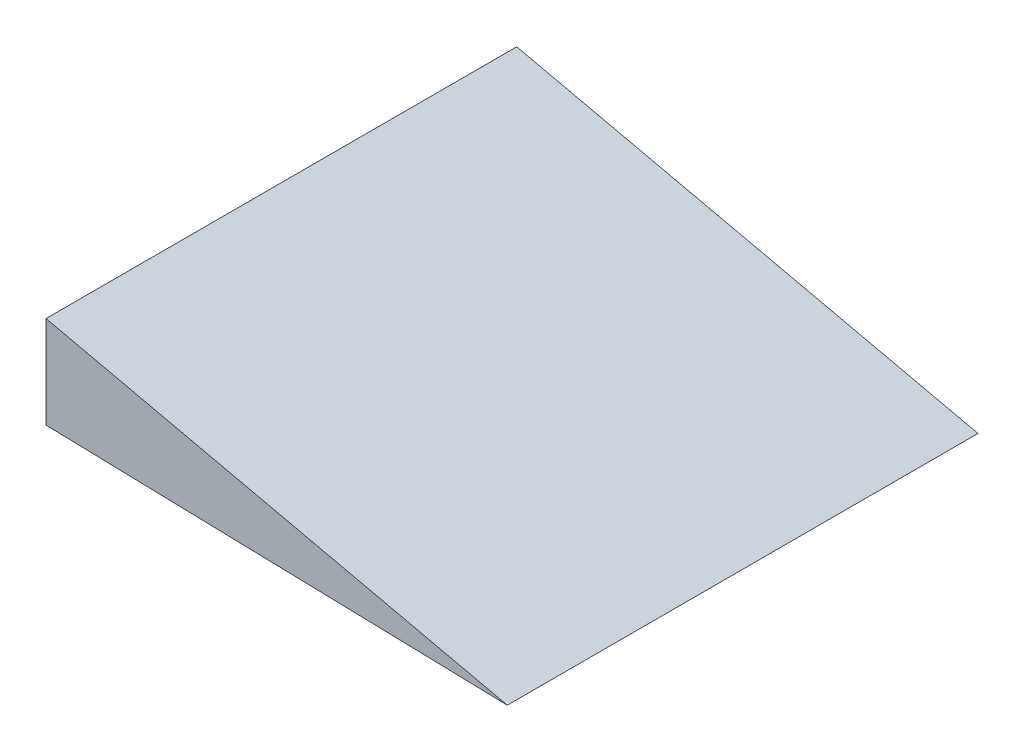
ISO-10303-21;
HEADER;
FILE_DESCRIPTION(('STEP AP214'),'2;1');
FILE_NAME('part.step','',(''),(''),'','','');
FILE_SCHEMA(('AUTOMOTIVE_DESIGN { 1 0 10303 214 1 1 1 1 }'));
ENDSEC;
DATA;
#1=APPLICATION_CONTEXT('core data for automotive mechanical design processes');
#2=APPLICATION_PROTOCOL_DEFINITION('international standard','automotive_design',2000,#1);
#3=PRODUCT_CONTEXT('',#1,'mechanical');
#4=PRODUCT('Part','Part','',(#3));
#5=PRODUCT_RELATED_PRODUCT_CATEGORY('part','',(#4));
#6=PRODUCT_DEFINITION_FORMATION('','',#4);
#7=PRODUCT_DEFINITION_CONTEXT('part definition',#1,'design');
#8=PRODUCT_DEFINITION('design','',#6,#7);
#9=PRODUCT_DEFINITION_SHAPE('','',#8);
#10=(LENGTH_UNIT() NAMED_UNIT(*) SI_UNIT(.MILLI.,.METRE.));
#11=(NAMED_UNIT(*) PLANE_ANGLE_UNIT() SI_UNIT($,.RADIAN.));
#12=(NAMED_UNIT(*) SI_UNIT($,.STERADIAN.) SOLID_ANGLE_UNIT());
#13=UNCERTAINTY_MEASURE_WITH_UNIT(LENGTH_MEASURE(1.E-05),#10,'distance_accuracy_value','');
#14=(GEOMETRIC_REPRESENTATION_CONTEXT(3) GLOBAL_UNCERTAINTY_ASSIGNED_CONTEXT((#13)) GLOBAL_UNIT_ASSIGNED_CONTEXT((#10,
#11,#12)) REPRESENTATION_CONTEXT('',''));
#15=CARTESIAN_POINT('',(0.,0.,0.));
#16=DIRECTION('',(0.,0.,1.));
#17=DIRECTION('',(1.,0.,0.));
#18=AXIS2_PLACEMENT_3D('',#15,#16,#17);
#19=CARTESIAN_POINT('',(78.8343772829701,-9.19981161972341,102.));
#20=DIRECTION('',(-0.220344878282843,-0.975422028977467,0.));
#21=DIRECTION('',(0.975422028977467,-0.220344878282843,0.));
#22=AXIS2_PLACEMENT_3D('',#19,#20,#21);
#23=PLANE('',#22);
#24=DIRECTION('',(-0.975422028977467,0.220344878282843,0.));
#25=VECTOR('',#24,1.);
#26=CARTESIAN_POINT('',(78.8343772829701,-9.19981161972341,0.));
#27=LINE('',#26,#25);
#28=CARTESIAN_POINT('',(78.8343772829701,-9.19981161972341,0.));
#29=VERTEX_POINT('',#28);
#30=CARTESIAN_POINT('',(-21.1322792890111,13.3823529411765,0.));
#31=VERTEX_POINT('',#30);
#32=EDGE_CURVE('E80',#29,#31,#27,.T.);
#33=ORIENTED_EDGE('',*,*,#32,.T.);
#34=DIRECTION('',(0.,0.,-1.));
#35=VECTOR('',#34,1.);
#36=CARTESIAN_POINT('',(-21.1322792890111,13.3823529411765,102.));
#37=LINE('',#36,#35);
#38=CARTESIAN_POINT('',(-21.1322792890111,13.3823529411765,102.));
#39=VERTEX_POINT('',#38);
#40=EDGE_CURVE('E11',#39,#31,#37,.T.);
#41=ORIENTED_EDGE('',*,*,#40,.F.);
#42=DIRECTION('',(-0.975422028977467,0.220344878282843,0.));
#43=VECTOR('',#42,1.);
#44=CARTESIAN_POINT('',(78.8343772829701,-9.19981161972341,102.));
#45=LINE('',#44,#43);
#46=CARTESIAN_POINT('',(78.8343772829701,-9.19981161972341,102.));
#47=VERTEX_POINT('',#46);
#48=EDGE_CURVE('E73',#47,#39,#45,.T.);
#49=ORIENTED_EDGE('',*,*,#48,.F.);
#50=DIRECTION('',(0.,0.,-1.));
#51=VECTOR('',#50,1.);
#52=CARTESIAN_POINT('',(78.8343772829701,-9.19981161972341,102.));
#53=LINE('',#52,#51);
#54=EDGE_CURVE('E81',#47,#29,#53,.T.);
#55=ORIENTED_EDGE('',*,*,#54,.T.);
#56=EDGE_LOOP('',(#33,#41,#49,#55));
#57=FACE_BOUND('',#56,.T.);
#58=ADVANCED_FACE('F33',(#57),#23,.F.);
#59=CARTESIAN_POINT('',(-21.1322792890111,13.3823529411765,102.));
#60=DIRECTION('',(1.,0.,0.));
#61=DIRECTION('',(0.,0.,-1.));
#62=AXIS2_PLACEMENT_3D('',#59,#60,#61);
#63=PLANE('',#62);
#64=DIRECTION('',(0.,-1.,0.));
#65=VECTOR('',#64,1.);
#66=CARTESIAN_POINT('',(-21.1322792890111,13.3823529411765,0.));
#67=LINE('',#66,#65);
#68=CARTESIAN_POINT('',(-21.1322792890111,-6.61764705882353,0.));
#69=VERTEX_POINT('',#68);
#70=EDGE_CURVE('E61',#31,#69,#67,.T.);
#71=ORIENTED_EDGE('',*,*,#70,.T.);
#72=DIRECTION('',(0.,0.,-1.));
#73=VECTOR('',#72,1.);
#74=CARTESIAN_POINT('',(-21.1322792890111,-6.61764705882353,102.));
#75=LINE('',#74,#73);
#76=CARTESIAN_POINT('',(-21.1322792890111,-6.61764705882353,102.));
#77=VERTEX_POINT('',#76);
#78=EDGE_CURVE('E41',#77,#69,#75,.T.);
#79=ORIENTED_EDGE('',*,*,#78,.F.);
#80=DIRECTION('',(0.,-1.,0.));
#81=VECTOR('',#80,1.);
#82=CARTESIAN_POINT('',(-21.1322792890111,13.3823529411765,102.));
#83=LINE('',#82,#81);
#84=EDGE_CURVE('E69',#39,#77,#83,.T.);
#85=ORIENTED_EDGE('',*,*,#84,.F.);
#86=ORIENTED_EDGE('',*,*,#40,.T.);
#87=EDGE_LOOP('',(#71,#79,#85,#86));
#88=FACE_BOUND('',#87,.T.);
#89=ADVANCED_FACE('F70',(#88),#63,.F.);
#90=CARTESIAN_POINT('',(-21.1322792890111,-6.61764705882353,102.));
#91=DIRECTION('',(0.0258216456089988,0.999666565719812,0.));
#92=DIRECTION('',(-0.999666565719812,0.0258216456089988,0.));
#93=AXIS2_PLACEMENT_3D('',#90,#91,#92);
#94=PLANE('',#93);
#95=CARTESIAN_POINT('',(3.85938485398419,-7.2631881990485,77.));
#96=DIRECTION('',(-0.0258216456089988,-0.999666565719812,0.));
#97=DIRECTION('',(0.999666565719812,-0.0258216456089988,0.));
#98=AXIS2_PLACEMENT_3D('',#95,#96,#97);
#99=CIRCLE('',#98,1.5);
#100=CARTESIAN_POINT('',(5.35888470256391,-7.301920667462,77.));
#101=VERTEX_POINT('',#100);
#102=EDGE_CURVE('E119',#101,#101,#99,.T.);
#103=ORIENTED_EDGE('',*,*,#102,.F.);
#104=EDGE_LOOP('',(#103));
#105=FACE_BOUND('',#104,.T.);
#106=CARTESIAN_POINT('',(3.85938485398419,-7.2631881990485,25.));
#107=DIRECTION('',(-0.0258216456089988,-0.999666565719812,0.));
#108=DIRECTION('',(0.999666565719812,-0.0258216456089988,0.));
#109=AXIS2_PLACEMENT_3D('',#106,#107,#108);
#110=CIRCLE('',#109,1.5);
#111=CARTESIAN_POINT('',(5.35888470256391,-7.301920667462,25.));
#112=VERTEX_POINT('',#111);
#113=EDGE_CURVE('E87',#112,#112,#110,.T.);
#114=ORIENTED_EDGE('',*,*,#113,.F.);
#115=EDGE_LOOP('',(#114));
#116=FACE_BOUND('',#115,.T.);
#117=DIRECTION('',(0.999666565719812,-0.0258216456089988,0.));
#118=VECTOR('',#117,1.);
#119=CARTESIAN_POINT('',(-21.1322792890111,-6.61764705882353,0.));
#120=LINE('',#119,#118);
#121=EDGE_CURVE('E66',#69,#29,#120,.T.);
#122=ORIENTED_EDGE('',*,*,#121,.T.);
#123=ORIENTED_EDGE('',*,*,#54,.F.);
#124=DIRECTION('',(0.999666565719812,-0.0258216456089988,0.));
#125=VECTOR('',#124,1.);
#126=CARTESIAN_POINT('',(-21.1322792890111,-6.61764705882353,102.));
#127=LINE('',#126,#125);
#128=EDGE_CURVE('E49',#77,#47,#127,.T.);
#129=ORIENTED_EDGE('',*,*,#128,.F.);
#130=ORIENTED_EDGE('',*,*,#78,.T.);
#131=EDGE_LOOP('',(#122,#123,#129,#130));
#132=FACE_BOUND('',#131,.T.);
#133=ADVANCED_FACE('F92',(#105,#116,#132),#94,.F.);
#134=CARTESIAN_POINT('',(0.,0.,102.));
#135=DIRECTION('',(0.,0.,1.));
#136=DIRECTION('',(1.,0.,0.));
#137=AXIS2_PLACEMENT_3D('',#134,#135,#136);
#138=PLANE('',#137);
#139=ORIENTED_EDGE('',*,*,#48,.T.);
#140=ORIENTED_EDGE('',*,*,#84,.T.);
#141=ORIENTED_EDGE('',*,*,#128,.T.);
#142=EDGE_LOOP('',(#139,#140,#141));
#143=FACE_BOUND('',#142,.T.);
#144=ADVANCED_FACE('F76',(#143),#138,.T.);
#145=CARTESIAN_POINT('',(0.,0.,0.));
#146=DIRECTION('',(0.,0.,1.));
#147=DIRECTION('',(1.,0.,0.));
#148=AXIS2_PLACEMENT_3D('',#145,#146,#147);
#149=PLANE('',#148);
#150=ORIENTED_EDGE('',*,*,#32,.F.);
#151=ORIENTED_EDGE('',*,*,#121,.F.);
#152=ORIENTED_EDGE('',*,*,#70,.F.);
#153=EDGE_LOOP('',(#150,#151,#152));
#154=FACE_BOUND('',#153,.T.);
#155=ADVANCED_FACE('F93',(#154),#149,.F.);
#156=CARTESIAN_POINT('',(4.11760131007418,2.73347745814962,25.));
#157=DIRECTION('',(-0.0258216456089988,-0.999666565719812,0.));
#158=DIRECTION('',(0.999666565719812,-0.0258216456089988,0.));
#159=AXIS2_PLACEMENT_3D('',#156,#157,#158);
#160=CYLINDRICAL_SURFACE('',#159,1.5);
#161=CARTESIAN_POINT('',(4.11760131007418,2.73347745814962,25.));
#162=DIRECTION('',(-0.0258216456089988,-0.999666565719812,0.));
#163=DIRECTION('',(0.999666565719812,-0.0258216456089988,0.));
#164=AXIS2_PLACEMENT_3D('',#161,#162,#163);
#165=CIRCLE('',#164,1.5);
#166=CARTESIAN_POINT('',(5.6171011586539,2.69474498973612,25.));
#167=VERTEX_POINT('',#166);
#168=EDGE_CURVE('E83',#167,#167,#165,.T.);
#169=ORIENTED_EDGE('',*,*,#168,.F.);
#170=EDGE_LOOP('',(#169));
#171=FACE_BOUND('',#170,.T.);
#172=ORIENTED_EDGE('',*,*,#113,.T.);
#173=EDGE_LOOP('',(#172));
#174=FACE_BOUND('',#173,.T.);
#175=ADVANCED_FACE('F95',(#171,#174),#160,.F.);
#176=CARTESIAN_POINT('',(4.11760131007418,2.73347745814962,25.));
#177=DIRECTION('',(-0.0258216456089988,-0.999666565719812,0.));
#178=DIRECTION('',(0.999666565719812,-0.0258216456089988,0.));
#179=AXIS2_PLACEMENT_3D('',#176,#177,#178);
#180=PLANE('',#179);
#181=ORIENTED_EDGE('',*,*,#168,.T.);
#182=EDGE_LOOP('',(#181));
#183=FACE_BOUND('',#182,.T.);
#184=ADVANCED_FACE('F101',(#183),#180,.T.);
#185=CARTESIAN_POINT('',(4.11760131007418,2.73347745814962,77.));
#186=DIRECTION('',(-0.0258216456089988,-0.999666565719812,0.));
#187=DIRECTION('',(0.999666565719812,-0.0258216456089988,0.));
#188=AXIS2_PLACEMENT_3D('',#185,#186,#187);
#189=CYLINDRICAL_SURFACE('',#188,1.5);
#190=CARTESIAN_POINT('',(4.11760131007418,2.73347745814962,77.));
#191=DIRECTION('',(-0.0258216456089988,-0.999666565719812,0.));
#192=DIRECTION('',(0.999666565719812,-0.0258216456089988,0.));
#193=AXIS2_PLACEMENT_3D('',#190,#191,#192);
#194=CIRCLE('',#193,1.5);
#195=CARTESIAN_POINT('',(5.6171011586539,2.69474498973612,77.));
#196=VERTEX_POINT('',#195);
#197=EDGE_CURVE('E123',#196,#196,#194,.T.);
#198=ORIENTED_EDGE('',*,*,#197,.F.);
#199=EDGE_LOOP('',(#198));
#200=FACE_BOUND('',#199,.T.);
#201=ORIENTED_EDGE('',*,*,#102,.T.);
#202=EDGE_LOOP('',(#201));
#203=FACE_BOUND('',#202,.T.);
#204=ADVANCED_FACE('F129',(#200,#203),#189,.F.);
#205=CARTESIAN_POINT('',(4.11760131007418,2.73347745814962,77.));
#206=DIRECTION('',(-0.0258216456089988,-0.999666565719812,0.));
#207=DIRECTION('',(0.999666565719812,-0.0258216456089988,0.));
#208=AXIS2_PLACEMENT_3D('',#205,#206,#207);
#209=PLANE('',#208);
#210=ORIENTED_EDGE('',*,*,#197,.T.);
#211=EDGE_LOOP('',(#210));
#212=FACE_BOUND('',#211,.T.);
#213=ADVANCED_FACE('F131',(#212),#209,.T.);
#214=CLOSED_SHELL('',(#58,#89,#133,#144,#155,#175,#184,#204,#213));
#215=MANIFOLD_SOLID_BREP('B2',#214);
#216=ADVANCED_BREP_SHAPE_REPRESENTATION('',(#18,#215),#14);
#217=SHAPE_DEFINITION_REPRESENTATION(#9,#216);
ENDSEC;
END-ISO-10303-21;
